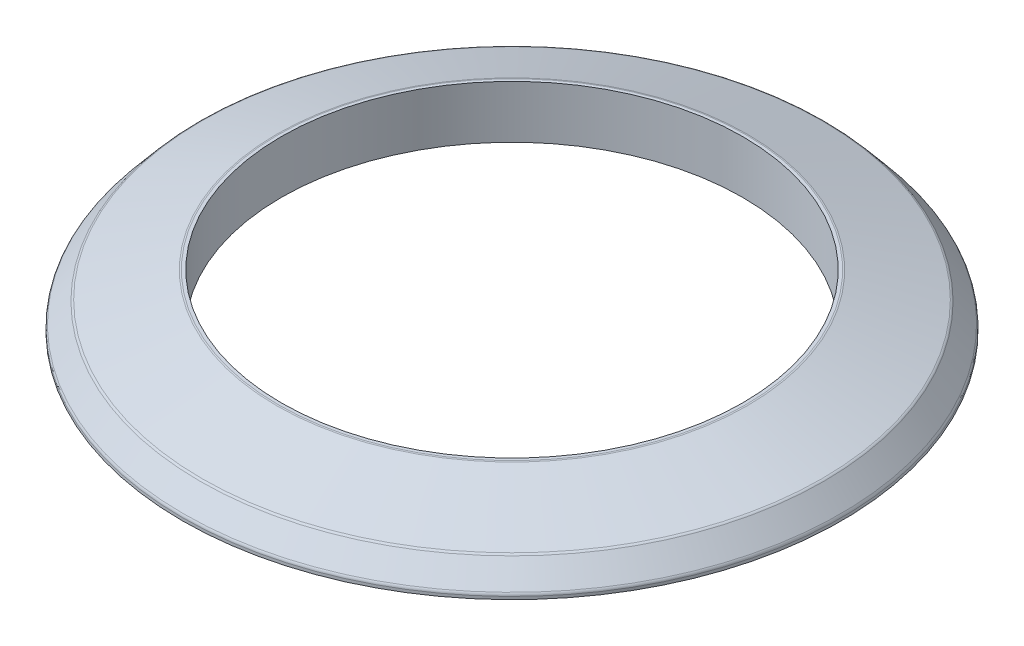
ISO-10303-21;
HEADER;
FILE_DESCRIPTION(('STEP AP214'),'2;1');
FILE_NAME('part.step','',(''),(''),'','','');
FILE_SCHEMA(('AUTOMOTIVE_DESIGN { 1 0 10303 214 1 1 1 1 }'));
ENDSEC;
DATA;
#1=APPLICATION_CONTEXT('core data for automotive mechanical design processes');
#2=APPLICATION_PROTOCOL_DEFINITION('international standard','automotive_design',2000,#1);
#3=PRODUCT_CONTEXT('',#1,'mechanical');
#4=PRODUCT('Part','Part','',(#3));
#5=PRODUCT_RELATED_PRODUCT_CATEGORY('part','',(#4));
#6=PRODUCT_DEFINITION_FORMATION('','',#4);
#7=PRODUCT_DEFINITION_CONTEXT('part definition',#1,'design');
#8=PRODUCT_DEFINITION('design','',#6,#7);
#9=PRODUCT_DEFINITION_SHAPE('','',#8);
#10=(LENGTH_UNIT() NAMED_UNIT(*) SI_UNIT(.MILLI.,.METRE.));
#11=(NAMED_UNIT(*) PLANE_ANGLE_UNIT() SI_UNIT($,.RADIAN.));
#12=(NAMED_UNIT(*) SI_UNIT($,.STERADIAN.) SOLID_ANGLE_UNIT());
#13=UNCERTAINTY_MEASURE_WITH_UNIT(LENGTH_MEASURE(1.E-05),#10,'distance_accuracy_value','');
#14=(GEOMETRIC_REPRESENTATION_CONTEXT(3) GLOBAL_UNCERTAINTY_ASSIGNED_CONTEXT((#13)) GLOBAL_UNIT_ASSIGNED_CONTEXT((#10,
#11,#12)) REPRESENTATION_CONTEXT('',''));
#15=CARTESIAN_POINT('',(0.,0.,0.));
#16=DIRECTION('',(0.,0.,1.));
#17=DIRECTION('',(1.,0.,0.));
#18=AXIS2_PLACEMENT_3D('',#15,#16,#17);
#19=CARTESIAN_POINT('',(0.,0.,0.));
#20=DIRECTION('',(0.,1.,0.));
#21=DIRECTION('',(0.,0.,1.));
#22=AXIS2_PLACEMENT_3D('',#19,#20,#21);
#23=PLANE('',#22);
#24=CARTESIAN_POINT('',(0.,0.,0.));
#25=DIRECTION('',(0.,1.,0.));
#26=DIRECTION('',(0.,0.,1.));
#27=AXIS2_PLACEMENT_3D('',#24,#25,#26);
#28=CIRCLE('',#27,19.05);
#29=CARTESIAN_POINT('',(0.,0.,-19.05));
#30=VERTEX_POINT('',#29);
#31=EDGE_CURVE('E71',#30,#30,#28,.T.);
#32=ORIENTED_EDGE('',*,*,#31,.F.);
#33=EDGE_LOOP('',(#32));
#34=FACE_BOUND('',#33,.T.);
#35=CARTESIAN_POINT('',(0.,0.,0.));
#36=DIRECTION('',(0.,1.,0.));
#37=DIRECTION('',(0.,0.,1.));
#38=AXIS2_PLACEMENT_3D('',#35,#36,#37);
#39=CIRCLE('',#38,13.335);
#40=CARTESIAN_POINT('',(0.,0.,-13.335));
#41=VERTEX_POINT('',#40);
#42=EDGE_CURVE('E75',#41,#41,#39,.T.);
#43=ORIENTED_EDGE('',*,*,#42,.T.);
#44=EDGE_LOOP('',(#43));
#45=FACE_BOUND('',#44,.T.);
#46=ADVANCED_FACE('F39',(#34,#45),#23,.F.);
#47=CARTESIAN_POINT('',(0.,1.524,0.));
#48=DIRECTION('',(0.,-1.,0.));
#49=DIRECTION('',(0.,0.,-1.));
#50=AXIS2_PLACEMENT_3D('',#47,#48,#49);
#51=CYLINDRICAL_SURFACE('',#50,19.05);
#52=CARTESIAN_POINT('',(0.,0.161551560496403,0.));
#53=DIRECTION('',(0.,1.,0.));
#54=DIRECTION('',(0.,0.,1.));
#55=AXIS2_PLACEMENT_3D('',#52,#53,#54);
#56=CIRCLE('',#55,19.05);
#57=CARTESIAN_POINT('',(0.,0.161551560496403,-19.05));
#58=VERTEX_POINT('',#57);
#59=EDGE_CURVE('E53',#58,#58,#56,.F.);
#60=CARTESIAN_POINT('',(0.,0.161551560496403,-19.05));
#61=CARTESIAN_POINT('',(0.,0.159868731741232,-19.05));
#62=CARTESIAN_POINT('',(0.,0.158185902986061,-19.05));
#63=CARTESIAN_POINT('',(0.,0.15482024547572,-19.05));
#64=CARTESIAN_POINT('',(0.,0.153137416720549,-19.05));
#65=CARTESIAN_POINT('',(0.,0.149771759210207,-19.05));
#66=CARTESIAN_POINT('',(0.,0.148088930455036,-19.05));
#67=CARTESIAN_POINT('',(0.,0.144723272944694,-19.05));
#68=CARTESIAN_POINT('',(0.,0.143040444189524,-19.05));
#69=CARTESIAN_POINT('',(0.,0.139674786679182,-19.05));
#70=CARTESIAN_POINT('',(0.,0.137991957924011,-19.05));
#71=CARTESIAN_POINT('',(0.,0.134626300413669,-19.05));
#72=CARTESIAN_POINT('',(0.,0.132943471658498,-19.05));
#73=CARTESIAN_POINT('',(0.,0.129577814148157,-19.05));
#74=CARTESIAN_POINT('',(0.,0.127894985392986,-19.05));
#75=CARTESIAN_POINT('',(0.,0.124529327882644,-19.05));
#76=CARTESIAN_POINT('',(0.,0.122846499127473,-19.05));
#77=CARTESIAN_POINT('',(0.,0.119480841617131,-19.05));
#78=CARTESIAN_POINT('',(0.,0.117798012861961,-19.05));
#79=CARTESIAN_POINT('',(0.,0.114432355351619,-19.05));
#80=CARTESIAN_POINT('',(0.,0.112749526596448,-19.05));
#81=CARTESIAN_POINT('',(0.,0.109383869086106,-19.05));
#82=CARTESIAN_POINT('',(0.,0.107701040330935,-19.05));
#83=CARTESIAN_POINT('',(0.,0.104335382820594,-19.05));
#84=CARTESIAN_POINT('',(0.,0.102652554065423,-19.05));
#85=CARTESIAN_POINT('',(0.,0.0992868965550809,-19.05));
#86=CARTESIAN_POINT('',(0.,0.09760406779991,-19.05));
#87=CARTESIAN_POINT('',(0.,0.0942384102895683,-19.05));
#88=CARTESIAN_POINT('',(0.,0.0925555815343975,-19.05));
#89=CARTESIAN_POINT('',(0.,0.0891899240240558,-19.05));
#90=CARTESIAN_POINT('',(0.,0.0875070952688849,-19.05));
#91=CARTESIAN_POINT('',(0.,0.0841414377585432,-19.05));
#92=CARTESIAN_POINT('',(0.,0.0824586090033723,-19.05));
#93=CARTESIAN_POINT('',(0.,0.0790929514930306,-19.05));
#94=CARTESIAN_POINT('',(0.,0.0774101227378598,-19.05));
#95=CARTESIAN_POINT('',(0.,0.0740444652275181,-19.05));
#96=CARTESIAN_POINT('',(0.,0.0723616364723472,-19.05));
#97=CARTESIAN_POINT('',(0.,0.0689959789620055,-19.05));
#98=CARTESIAN_POINT('',(0.,0.0673131502068346,-19.05));
#99=CARTESIAN_POINT('',(0.,0.0639474926964929,-19.05));
#100=CARTESIAN_POINT('',(0.,0.0622646639413221,-19.05));
#101=CARTESIAN_POINT('',(0.,0.0588990064309803,-19.05));
#102=CARTESIAN_POINT('',(0.,0.0572161776758094,-19.05));
#103=CARTESIAN_POINT('',(0.,0.0538505201654676,-19.05));
#104=CARTESIAN_POINT('',(0.,0.0521676914102967,-19.05));
#105=CARTESIAN_POINT('',(0.,0.048802033899955,-19.05));
#106=CARTESIAN_POINT('',(0.,0.0471192051447842,-19.05));
#107=CARTESIAN_POINT('',(0.,0.0437535476344425,-19.05));
#108=CARTESIAN_POINT('',(0.,0.0420707188792716,-19.05));
#109=CARTESIAN_POINT('',(0.,0.0387050613689299,-19.05));
#110=CARTESIAN_POINT('',(0.,0.037022232613759,-19.05));
#111=CARTESIAN_POINT('',(0.,0.0336565751034173,-19.05));
#112=CARTESIAN_POINT('',(0.,0.0319737463482465,-19.05));
#113=CARTESIAN_POINT('',(0.,0.0286080888379048,-19.05));
#114=CARTESIAN_POINT('',(0.,0.0269252600827339,-19.05));
#115=CARTESIAN_POINT('',(0.,0.0235596025723921,-19.05));
#116=CARTESIAN_POINT('',(0.,0.0218767738172212,-19.05));
#117=CARTESIAN_POINT('',(0.,0.0185111163068794,-19.05));
#118=CARTESIAN_POINT('',(0.,0.0168282875517086,-19.05));
#119=CARTESIAN_POINT('',(0.,0.0134626300413668,-19.05));
#120=CARTESIAN_POINT('',(0.,0.011779801286196,-19.05));
#121=CARTESIAN_POINT('',(0.,0.00841414377585428,-19.05));
#122=CARTESIAN_POINT('',(0.,0.00673131502068342,-19.05));
#123=CARTESIAN_POINT('',(0.,0.00336565751034171,-19.05));
#124=CARTESIAN_POINT('',(0.,0.00168282875517086,-19.05));
#125=CARTESIAN_POINT('',(0.,0.,-19.05));
#126=B_SPLINE_CURVE_WITH_KNOTS('',3,(#60,#61,#62,#63,#64,#65,#66,#67,#68,#69,#70,#71,#72,#73,
#74,#75,#76,#77,#78,#79,#80,#81,#82,#83,#84,#85,#86,#87,#88,#89,#90,#91,#92,#93,#94,#95,#96,#97,
#98,#99,#100,#101,#102,#103,#104,#105,#106,#107,#108,#109,#110,#111,#112,#113,#114,#115,#116,
#117,#118,#119,#120,#121,#122,#123,#124,#125),.UNSPECIFIED.,.F.,.F.,(4,2,2,2,2,2,2,2,2,2,2,2,2,
2,2,2,2,2,2,2,2,2,2,2,2,2,2,2,2,2,2,2,4),(0.,0.00504848626551257,0.0100969725310251,
0.0151454587965377,0.0201939450620503,0.025242431327563,0.0302909175930756,0.0353394038585882,
0.0403878901241007,0.0454363763896133,0.0504848626551259,0.0555333489206385,0.0605818351861512,
0.0656303214516638,0.0706788077171764,0.0757272939826889,0.0807757802482015,0.0858242665137141,
0.0908727527792266,0.0959212390447392,0.100969725310252,0.106018211575765,0.111066697841277,
0.11611518410679,0.121163670372302,0.126212156637815,0.131260642903327,0.13630912916884,
0.141357615434353,0.146406101699865,0.151454587965378,0.15650307423089,0.161551560496403),.UNSPECIFIED.);
#127=EDGE_CURVE('BSEAM102',#58,#30,#126,.T.);
#128=ORIENTED_EDGE('',*,*,#59,.T.);
#129=ORIENTED_EDGE('',*,*,#31,.T.);
#130=ORIENTED_EDGE('',*,*,#127,.T.);
#131=ORIENTED_EDGE('',*,*,#127,.F.);
#132=EDGE_LOOP('',(#128,#130,#129,#131));
#133=FACE_BOUND('',#132,.T.);
#134=ADVANCED_FACE('F102',(#133),#51,.T.);
#135=CARTESIAN_POINT('',(0.,1.524,0.));
#136=DIRECTION('',(0.,-1.,0.));
#137=DIRECTION('',(0.,0.,-1.));
#138=AXIS2_PLACEMENT_3D('',#135,#136,#137);
#139=CYLINDRICAL_SURFACE('',#138,13.335);
#140=CARTESIAN_POINT('',(0.,3.048,0.));
#141=DIRECTION('',(0.,1.,0.));
#142=DIRECTION('',(0.,0.,1.));
#143=AXIS2_PLACEMENT_3D('',#140,#141,#142);
#144=CIRCLE('',#143,13.335);
#145=CARTESIAN_POINT('',(0.,3.048,-13.335));
#146=VERTEX_POINT('',#145);
#147=EDGE_CURVE('E79',#146,#146,#144,.T.);
#148=CARTESIAN_POINT('',(0.,0.,-13.335));
#149=CARTESIAN_POINT('',(0.,0.03175,-13.335));
#150=CARTESIAN_POINT('',(0.,0.0635000000000001,-13.335));
#151=CARTESIAN_POINT('',(0.,0.127,-13.335));
#152=CARTESIAN_POINT('',(0.,0.15875,-13.335));
#153=CARTESIAN_POINT('',(0.,0.22225,-13.335));
#154=CARTESIAN_POINT('',(0.,0.254,-13.335));
#155=CARTESIAN_POINT('',(0.,0.3175,-13.335));
#156=CARTESIAN_POINT('',(0.,0.34925,-13.335));
#157=CARTESIAN_POINT('',(0.,0.41275,-13.335));
#158=CARTESIAN_POINT('',(0.,0.4445,-13.335));
#159=CARTESIAN_POINT('',(0.,0.508,-13.335));
#160=CARTESIAN_POINT('',(0.,0.53975,-13.335));
#161=CARTESIAN_POINT('',(0.,0.60325,-13.335));
#162=CARTESIAN_POINT('',(0.,0.635,-13.335));
#163=CARTESIAN_POINT('',(0.,0.6985,-13.335));
#164=CARTESIAN_POINT('',(0.,0.73025,-13.335));
#165=CARTESIAN_POINT('',(0.,0.79375,-13.335));
#166=CARTESIAN_POINT('',(0.,0.8255,-13.335));
#167=CARTESIAN_POINT('',(0.,0.889,-13.335));
#168=CARTESIAN_POINT('',(0.,0.92075,-13.335));
#169=CARTESIAN_POINT('',(0.,0.98425,-13.335));
#170=CARTESIAN_POINT('',(0.,1.016,-13.335));
#171=CARTESIAN_POINT('',(0.,1.0795,-13.335));
#172=CARTESIAN_POINT('',(0.,1.11125,-13.335));
#173=CARTESIAN_POINT('',(0.,1.17475,-13.335));
#174=CARTESIAN_POINT('',(0.,1.2065,-13.335));
#175=CARTESIAN_POINT('',(0.,1.27,-13.335));
#176=CARTESIAN_POINT('',(0.,1.30175,-13.335));
#177=CARTESIAN_POINT('',(0.,1.36525,-13.335));
#178=CARTESIAN_POINT('',(0.,1.397,-13.335));
#179=CARTESIAN_POINT('',(0.,1.4605,-13.335));
#180=CARTESIAN_POINT('',(0.,1.49225,-13.335));
#181=CARTESIAN_POINT('',(0.,1.55575,-13.335));
#182=CARTESIAN_POINT('',(0.,1.5875,-13.335));
#183=CARTESIAN_POINT('',(0.,1.651,-13.335));
#184=CARTESIAN_POINT('',(0.,1.68275,-13.335));
#185=CARTESIAN_POINT('',(0.,1.74625,-13.335));
#186=CARTESIAN_POINT('',(0.,1.778,-13.335));
#187=CARTESIAN_POINT('',(0.,1.8415,-13.335));
#188=CARTESIAN_POINT('',(0.,1.87325,-13.335));
#189=CARTESIAN_POINT('',(0.,1.93675,-13.335));
#190=CARTESIAN_POINT('',(0.,1.9685,-13.335));
#191=CARTESIAN_POINT('',(0.,2.032,-13.335));
#192=CARTESIAN_POINT('',(0.,2.06375,-13.335));
#193=CARTESIAN_POINT('',(0.,2.12725,-13.335));
#194=CARTESIAN_POINT('',(0.,2.159,-13.335));
#195=CARTESIAN_POINT('',(0.,2.2225,-13.335));
#196=CARTESIAN_POINT('',(0.,2.25425,-13.335));
#197=CARTESIAN_POINT('',(0.,2.31775,-13.335));
#198=CARTESIAN_POINT('',(0.,2.3495,-13.335));
#199=CARTESIAN_POINT('',(0.,2.413,-13.335));
#200=CARTESIAN_POINT('',(0.,2.44475,-13.335));
#201=CARTESIAN_POINT('',(0.,2.50825,-13.335));
#202=CARTESIAN_POINT('',(0.,2.54,-13.335));
#203=CARTESIAN_POINT('',(0.,2.6035,-13.335));
#204=CARTESIAN_POINT('',(0.,2.63525,-13.335));
#205=CARTESIAN_POINT('',(0.,2.69875,-13.335));
#206=CARTESIAN_POINT('',(0.,2.7305,-13.335));
#207=CARTESIAN_POINT('',(0.,2.794,-13.335));
#208=CARTESIAN_POINT('',(0.,2.82575,-13.335));
#209=CARTESIAN_POINT('',(0.,2.88925,-13.335));
#210=CARTESIAN_POINT('',(0.,2.921,-13.335));
#211=CARTESIAN_POINT('',(0.,2.9845,-13.335));
#212=CARTESIAN_POINT('',(0.,3.01625,-13.335));
#213=CARTESIAN_POINT('',(0.,3.048,-13.335));
#214=B_SPLINE_CURVE_WITH_KNOTS('',3,(#148,#149,#150,#151,#152,#153,#154,#155,#156,#157,#158,
#159,#160,#161,#162,#163,#164,#165,#166,#167,#168,#169,#170,#171,#172,#173,#174,#175,#176,#177,
#178,#179,#180,#181,#182,#183,#184,#185,#186,#187,#188,#189,#190,#191,#192,#193,#194,#195,#196,
#197,#198,#199,#200,#201,#202,#203,#204,#205,#206,#207,#208,#209,#210,#211,#212,#213),
.UNSPECIFIED.,.F.,.F.,(4,2,2,2,2,2,2,2,2,2,2,2,2,2,2,2,2,2,2,2,2,2,2,2,2,2,2,2,2,2,2,2,4),(0.,
0.0952500000000001,0.1905,0.28575,0.381,0.47625,0.5715,0.66675,0.762,0.85725,0.9525,1.04775,
1.143,1.23825,1.3335,1.42875,1.524,1.61925,1.7145,1.80975,1.905,2.00025,2.0955,2.19075,2.286,
2.38125,2.4765,2.57175,2.667,2.76225,2.8575,2.95275,3.048),.UNSPECIFIED.);
#215=EDGE_CURVE('BSEAM84',#41,#146,#214,.T.);
#216=ORIENTED_EDGE('',*,*,#42,.F.);
#217=ORIENTED_EDGE('',*,*,#147,.T.);
#218=ORIENTED_EDGE('',*,*,#215,.T.);
#219=ORIENTED_EDGE('',*,*,#215,.F.);
#220=EDGE_LOOP('',(#216,#218,#217,#219));
#221=FACE_BOUND('',#220,.T.);
#222=ADVANCED_FACE('F84',(#221),#139,.F.);
#223=CARTESIAN_POINT('',(0.,1.524,0.));
#224=DIRECTION('',(0.,-1.,0.));
#225=DIRECTION('',(0.,0.,-1.));
#226=AXIS2_PLACEMENT_3D('',#223,#224,#225);
#227=CONICAL_SURFACE('',#226,17.9843434684049,0.69813170079773);
#228=CARTESIAN_POINT('',(0.,0.324819613356784,0.));
#229=DIRECTION('',(0.,-1.,0.));
#230=DIRECTION('',(0.,0.,-1.));
#231=AXIS2_PLACEMENT_3D('',#228,#229,#230);
#232=CIRCLE('',#231,18.9905752885522);
#233=CARTESIAN_POINT('',(0.,0.324819613356784,-18.9905752885522));
#234=VERTEX_POINT('',#233);
#235=EDGE_CURVE('E10',#234,#234,#232,.F.);
#236=ORIENTED_EDGE('',*,*,#235,.T.);
#237=EDGE_LOOP('',(#236));
#238=FACE_BOUND('',#237,.T.);
#239=CARTESIAN_POINT('',(0.,1.47003949681695,0.));
#240=DIRECTION('',(0.,1.,0.));
#241=DIRECTION('',(0.,0.,1.));
#242=AXIS2_PLACEMENT_3D('',#239,#240,#241);
#243=CIRCLE('',#242,18.0296217067239);
#244=CARTESIAN_POINT('',(0.,1.47003949681695,18.0296217067239));
#245=VERTEX_POINT('',#244);
#246=EDGE_CURVE('E47',#245,#245,#243,.F.);
#247=ORIENTED_EDGE('',*,*,#246,.T.);
#248=EDGE_LOOP('',(#247));
#249=FACE_BOUND('',#248,.T.);
#250=ADVANCED_FACE('F89',(#238,#249),#227,.T.);
#251=CARTESIAN_POINT('',(0.,3.048,0.));
#252=DIRECTION('',(0.,1.,0.));
#253=DIRECTION('',(0.,0.,1.));
#254=AXIS2_PLACEMENT_3D('',#251,#252,#253);
#255=PLANE('',#254);
#256=CARTESIAN_POINT('',(0.,3.048,0.));
#257=DIRECTION('',(0.,1.,0.));
#258=DIRECTION('',(0.,0.,1.));
#259=AXIS2_PLACEMENT_3D('',#256,#257,#258);
#260=CIRCLE('',#259,13.5158210681203);
#261=CARTESIAN_POINT('',(0.,3.048,13.5158210681203));
#262=VERTEX_POINT('',#261);
#263=EDGE_CURVE('E67',#262,#262,#260,.T.);
#264=ORIENTED_EDGE('',*,*,#263,.T.);
#265=EDGE_LOOP('',(#264));
#266=FACE_BOUND('',#265,.T.);
#267=ORIENTED_EDGE('',*,*,#147,.F.);
#268=EDGE_LOOP('',(#267));
#269=FACE_BOUND('',#268,.T.);
#270=ADVANCED_FACE('F86',(#266,#269),#255,.T.);
#271=CARTESIAN_POINT('',(0.,3.048,0.));
#272=DIRECTION('',(0.,-1.,0.));
#273=DIRECTION('',(0.,0.,-1.));
#274=AXIS2_PLACEMENT_3D('',#271,#272,#273);
#275=CONICAL_SURFACE('',#274,13.558326090827,1.23918376891597);
#276=CARTESIAN_POINT('',(0.,3.03416171820223,0.));
#277=DIRECTION('',(0.,1.,0.));
#278=DIRECTION('',(0.,0.,1.));
#279=AXIS2_PLACEMENT_3D('',#276,#277,#278);
#280=CIRCLE('',#279,13.5985153793524);
#281=CARTESIAN_POINT('',(0.,3.03416171820223,13.5985153793524));
#282=VERTEX_POINT('',#281);
#283=EDGE_CURVE('E58',#282,#282,#280,.F.);
#284=ORIENTED_EDGE('',*,*,#283,.T.);
#285=EDGE_LOOP('',(#284));
#286=FACE_BOUND('',#285,.T.);
#287=CARTESIAN_POINT('',(0.,1.54693316215879,0.));
#288=DIRECTION('',(0.,1.,0.));
#289=DIRECTION('',(0.,0.,1.));
#290=AXIS2_PLACEMENT_3D('',#287,#288,#289);
#291=CIRCLE('',#290,17.9177407294038);
#292=CARTESIAN_POINT('',(0.,1.54693316215879,17.9177407294038));
#293=VERTEX_POINT('',#292);
#294=EDGE_CURVE('E64',#293,#293,#291,.T.);
#295=ORIENTED_EDGE('',*,*,#294,.T.);
#296=EDGE_LOOP('',(#295));
#297=FACE_BOUND('',#296,.T.);
#298=ADVANCED_FACE('F88',(#286,#297),#275,.T.);
#299=CARTESIAN_POINT('',(0.,2.794,0.));
#300=DIRECTION('',(0.,1.,0.));
#301=DIRECTION('',(0.,0.,1.));
#302=AXIS2_PLACEMENT_3D('',#299,#300,#301);
#303=TOROIDAL_SURFACE('',#302,13.5158210681203,0.254);
#304=ORIENTED_EDGE('',*,*,#283,.F.);
#305=EDGE_LOOP('',(#304));
#306=FACE_BOUND('',#305,.T.);
#307=ORIENTED_EDGE('',*,*,#263,.F.);
#308=EDGE_LOOP('',(#307));
#309=FACE_BOUND('',#308,.T.);
#310=ADVANCED_FACE('F96',(#306,#309),#303,.T.);
#311=CARTESIAN_POINT('',(0.,0.161551560496403,0.));
#312=DIRECTION('',(0.,1.,0.));
#313=DIRECTION('',(0.,0.,1.));
#314=AXIS2_PLACEMENT_3D('',#311,#312,#313);
#315=TOROIDAL_SURFACE('',#314,18.796,0.254);
#316=ORIENTED_EDGE('',*,*,#235,.F.);
#317=EDGE_LOOP('',(#316));
#318=FACE_BOUND('',#317,.T.);
#319=ORIENTED_EDGE('',*,*,#59,.F.);
#320=EDGE_LOOP('',(#319));
#321=FACE_BOUND('',#320,.T.);
#322=ADVANCED_FACE('F114',(#318,#321),#315,.T.);
#323=CARTESIAN_POINT('',(0.,1.30677144395657,0.));
#324=DIRECTION('',(0.,-1.,0.));
#325=DIRECTION('',(0.,0.,-1.));
#326=AXIS2_PLACEMENT_3D('',#323,#324,#325);
#327=TOROIDAL_SURFACE('',#326,17.8350464181717,0.254);
#328=ORIENTED_EDGE('',*,*,#246,.F.);
#329=EDGE_LOOP('',(#328));
#330=FACE_BOUND('',#329,.T.);
#331=ORIENTED_EDGE('',*,*,#294,.F.);
#332=EDGE_LOOP('',(#331));
#333=FACE_BOUND('',#332,.T.);
#334=ADVANCED_FACE('F41',(#330,#333),#327,.T.);
#335=CLOSED_SHELL('',(#46,#134,#222,#250,#270,#298,#310,#322,#334));
#336=MANIFOLD_SOLID_BREP('B2',#335);
#337=ADVANCED_BREP_SHAPE_REPRESENTATION('',(#18,#336),#14);
#338=SHAPE_DEFINITION_REPRESENTATION(#9,#337);
ENDSEC;
END-ISO-10303-21;
